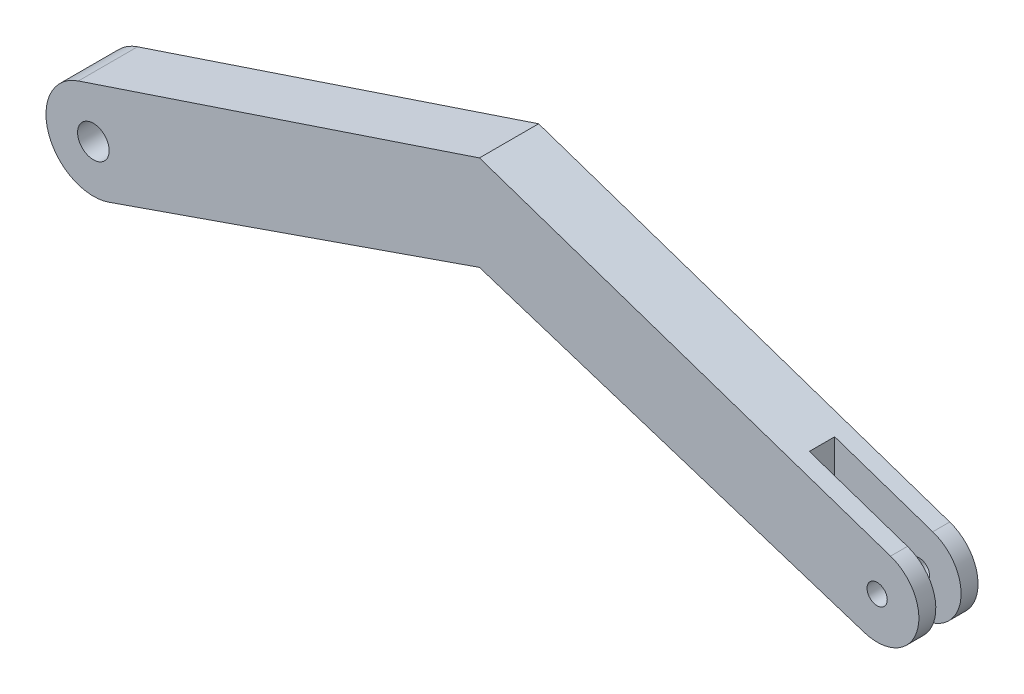
ISO-10303-21;
HEADER;
FILE_DESCRIPTION(('STEP AP214'),'2;1');
FILE_NAME('part.step','',(''),(''),'','','');
FILE_SCHEMA(('AUTOMOTIVE_DESIGN { 1 0 10303 214 1 1 1 1 }'));
ENDSEC;
DATA;
#1=APPLICATION_CONTEXT('core data for automotive mechanical design processes');
#2=APPLICATION_PROTOCOL_DEFINITION('international standard','automotive_design',2000,#1);
#3=PRODUCT_CONTEXT('',#1,'mechanical');
#4=PRODUCT('Part','Part','',(#3));
#5=PRODUCT_RELATED_PRODUCT_CATEGORY('part','',(#4));
#6=PRODUCT_DEFINITION_FORMATION('','',#4);
#7=PRODUCT_DEFINITION_CONTEXT('part definition',#1,'design');
#8=PRODUCT_DEFINITION('design','',#6,#7);
#9=PRODUCT_DEFINITION_SHAPE('','',#8);
#10=(LENGTH_UNIT() NAMED_UNIT(*) SI_UNIT(.MILLI.,.METRE.));
#11=(NAMED_UNIT(*) PLANE_ANGLE_UNIT() SI_UNIT($,.RADIAN.));
#12=(NAMED_UNIT(*) SI_UNIT($,.STERADIAN.) SOLID_ANGLE_UNIT());
#13=UNCERTAINTY_MEASURE_WITH_UNIT(LENGTH_MEASURE(1.E-05),#10,'distance_accuracy_value','');
#14=(GEOMETRIC_REPRESENTATION_CONTEXT(3) GLOBAL_UNCERTAINTY_ASSIGNED_CONTEXT((#13)) GLOBAL_UNIT_ASSIGNED_CONTEXT((#10,
#11,#12)) REPRESENTATION_CONTEXT('',''));
#15=CARTESIAN_POINT('',(0.,0.,0.));
#16=DIRECTION('',(0.,0.,1.));
#17=DIRECTION('',(1.,0.,0.));
#18=AXIS2_PLACEMENT_3D('',#15,#16,#17);
#19=CARTESIAN_POINT('',(0.,0.,2.9718));
#20=DIRECTION('',(0.,0.,-1.));
#21=DIRECTION('',(-1.,0.,0.));
#22=AXIS2_PLACEMENT_3D('',#19,#20,#21);
#23=CYLINDRICAL_SURFACE('',#22,2.0955);
#24=DIRECTION('',(0.,0.,-1.));
#25=VECTOR('',#24,1.);
#26=CARTESIAN_POINT('',(-0.641288820616134,-1.99496087644665,2.9718));
#27=LINE('',#26,#25);
#28=CARTESIAN_POINT('',(-0.641288820616134,-1.99496087644665,2.9718));
#29=VERTEX_POINT('',#28);
#30=CARTESIAN_POINT('',(-0.641288820616133,-1.99496087644665,2.1209));
#31=VERTEX_POINT('',#30);
#32=EDGE_CURVE('E161',#29,#31,#27,.T.);
#33=ORIENTED_EDGE('',*,*,#32,.T.);
#34=CARTESIAN_POINT('',(0.,0.,2.1209));
#35=DIRECTION('',(0.,0.,1.));
#36=DIRECTION('',(1.,0.,0.));
#37=AXIS2_PLACEMENT_3D('',#34,#35,#36);
#38=CIRCLE('',#37,2.0955);
#39=CARTESIAN_POINT('',(0.672616275683253,1.98461774548299,2.1209));
#40=VERTEX_POINT('',#39);
#41=EDGE_CURVE('E192',#31,#40,#38,.T.);
#42=ORIENTED_EDGE('',*,*,#41,.T.);
#43=DIRECTION('',(0.,0.,-1.));
#44=VECTOR('',#43,1.);
#45=CARTESIAN_POINT('',(0.672616275683253,1.98461774548299,2.9718));
#46=LINE('',#45,#44);
#47=CARTESIAN_POINT('',(0.672616275683253,1.98461774548299,2.9718));
#48=VERTEX_POINT('',#47);
#49=EDGE_CURVE('E157',#48,#40,#46,.T.);
#50=ORIENTED_EDGE('',*,*,#49,.F.);
#51=CARTESIAN_POINT('',(0.,0.,2.9718));
#52=DIRECTION('',(0.,0.,1.));
#53=DIRECTION('',(1.,0.,0.));
#54=AXIS2_PLACEMENT_3D('',#51,#52,#53);
#55=CIRCLE('',#54,2.0955);
#56=EDGE_CURVE('E98',#29,#48,#55,.T.);
#57=ORIENTED_EDGE('',*,*,#56,.F.);
#58=EDGE_LOOP('',(#33,#42,#50,#57));
#59=FACE_BOUND('',#58,.T.);
#60=ADVANCED_FACE('F37',(#59),#23,.T.);
#61=CARTESIAN_POINT('',(-0.641288820616135,-1.99496087644665,2.9718));
#62=DIRECTION('',(0.306031410458666,0.952021415627127,0.));
#63=DIRECTION('',(-0.952021415627128,0.306031410458666,0.));
#64=AXIS2_PLACEMENT_3D('',#61,#62,#63);
#65=PLANE('',#64);
#66=DIRECTION('',(0.,0.,1.));
#67=VECTOR('',#66,1.);
#68=CARTESIAN_POINT('',(-4.2545,-0.833478481868933,2.9718));
#69=LINE('',#68,#67);
#70=CARTESIAN_POINT('',(-4.2545,-0.833478481868932,0.8509));
#71=VERTEX_POINT('',#70);
#72=CARTESIAN_POINT('',(-4.2545,-0.833478481868932,2.1209));
#73=VERTEX_POINT('',#72);
#74=EDGE_CURVE('E194',#71,#73,#69,.T.);
#75=ORIENTED_EDGE('',*,*,#74,.T.);
#76=DIRECTION('',(0.952021415627128,-0.306031410458666,0.));
#77=VECTOR('',#76,1.);
#78=CARTESIAN_POINT('',(-0.641288820616135,-1.99496087644665,2.1209));
#79=LINE('',#78,#77);
#80=EDGE_CURVE('E139',#73,#31,#79,.T.);
#81=ORIENTED_EDGE('',*,*,#80,.T.);
#82=ORIENTED_EDGE('',*,*,#32,.F.);
#83=DIRECTION('',(0.952021415627127,-0.306031410458666,0.));
#84=VECTOR('',#83,1.);
#85=CARTESIAN_POINT('',(-0.641288820616135,-1.99496087644665,2.9718));
#86=LINE('',#85,#84);
#87=CARTESIAN_POINT('',(-19.9775441457523,4.2207622081462,2.9718));
#88=VERTEX_POINT('',#87);
#89=EDGE_CURVE('E203',#88,#29,#86,.T.);
#90=ORIENTED_EDGE('',*,*,#89,.F.);
#91=DIRECTION('',(0.,0.,-1.));
#92=VECTOR('',#91,1.);
#93=CARTESIAN_POINT('',(-19.9775441457523,4.2207622081462,2.9718));
#94=LINE('',#93,#92);
#95=CARTESIAN_POINT('',(-19.9775441457523,4.2207622081462,0.));
#96=VERTEX_POINT('',#95);
#97=EDGE_CURVE('E134',#88,#96,#94,.T.);
#98=ORIENTED_EDGE('',*,*,#97,.T.);
#99=DIRECTION('',(0.952021415627127,-0.306031410458666,0.));
#100=VECTOR('',#99,1.);
#101=CARTESIAN_POINT('',(-0.641288820616135,-1.99496087644665,0.));
#102=LINE('',#101,#100);
#103=CARTESIAN_POINT('',(-0.641288820616134,-1.99496087644665,0.));
#104=VERTEX_POINT('',#103);
#105=EDGE_CURVE('E138',#96,#104,#102,.T.);
#106=ORIENTED_EDGE('',*,*,#105,.T.);
#107=CARTESIAN_POINT('',(-0.641288820616133,-1.99496087644665,0.8509));
#108=VERTEX_POINT('',#107);
#109=EDGE_CURVE('E160',#108,#104,#27,.T.);
#110=ORIENTED_EDGE('',*,*,#109,.F.);
#111=DIRECTION('',(-0.952021415627128,0.306031410458666,0.));
#112=VECTOR('',#111,1.);
#113=CARTESIAN_POINT('',(-0.641288820616135,-1.99496087644665,0.8509));
#114=LINE('',#113,#112);
#115=EDGE_CURVE('E197',#108,#71,#114,.T.);
#116=ORIENTED_EDGE('',*,*,#115,.T.);
#117=EDGE_LOOP('',(#75,#81,#82,#90,#98,#106,#110,#116));
#118=FACE_BOUND('',#117,.T.);
#119=ADVANCED_FACE('F206',(#118),#65,.F.);
#120=CARTESIAN_POINT('',(0.672616275683253,1.98461774548299,0.8509));
#121=VERTEX_POINT('',#120);
#122=CARTESIAN_POINT('',(0.672616275683253,1.98461774548299,0.));
#123=VERTEX_POINT('',#122);
#124=EDGE_CURVE('E156',#121,#123,#46,.T.);
#125=ORIENTED_EDGE('',*,*,#124,.F.);
#126=CARTESIAN_POINT('',(0.,0.,0.8509));
#127=DIRECTION('',(0.,0.,-1.));
#128=DIRECTION('',(-1.,0.,0.));
#129=AXIS2_PLACEMENT_3D('',#126,#127,#128);
#130=CIRCLE('',#129,2.0955);
#131=EDGE_CURVE('E53',#121,#108,#130,.T.);
#132=ORIENTED_EDGE('',*,*,#131,.T.);
#133=ORIENTED_EDGE('',*,*,#109,.T.);
#134=CARTESIAN_POINT('',(0.,0.,0.));
#135=DIRECTION('',(0.,0.,1.));
#136=DIRECTION('',(1.,0.,0.));
#137=AXIS2_PLACEMENT_3D('',#134,#135,#136);
#138=CIRCLE('',#137,2.0955);
#139=EDGE_CURVE('E142',#104,#123,#138,.T.);
#140=ORIENTED_EDGE('',*,*,#139,.T.);
#141=EDGE_LOOP('',(#125,#132,#133,#140));
#142=FACE_BOUND('',#141,.T.);
#143=ADVANCED_FACE('F221',(#142),#23,.T.);
#144=CARTESIAN_POINT('',(0.672616275683252,1.98461774548299,2.9718));
#145=DIRECTION('',(0.320981281643165,0.947085538288232,0.));
#146=DIRECTION('',(-0.947085538288232,0.320981281643166,0.));
#147=AXIS2_PLACEMENT_3D('',#144,#145,#146);
#148=PLANE('',#147);
#149=DIRECTION('',(0.947085538288232,-0.320981281643166,0.));
#150=VECTOR('',#149,1.);
#151=CARTESIAN_POINT('',(0.672616275683252,1.98461774548299,2.1209));
#152=LINE('',#151,#150);
#153=CARTESIAN_POINT('',(-4.2545,3.65449024700185,2.1209));
#154=VERTEX_POINT('',#153);
#155=EDGE_CURVE('E11',#154,#40,#152,.T.);
#156=ORIENTED_EDGE('',*,*,#155,.F.);
#157=DIRECTION('',(0.,0.,1.));
#158=VECTOR('',#157,1.);
#159=CARTESIAN_POINT('',(-4.2545,3.65449024700185,2.9718));
#160=LINE('',#159,#158);
#161=CARTESIAN_POINT('',(-4.2545,3.65449024700185,0.8509));
#162=VERTEX_POINT('',#161);
#163=EDGE_CURVE('E46',#162,#154,#160,.T.);
#164=ORIENTED_EDGE('',*,*,#163,.F.);
#165=DIRECTION('',(-0.947085538288232,0.320981281643166,0.));
#166=VECTOR('',#165,1.);
#167=CARTESIAN_POINT('',(0.672616275683252,1.98461774548299,0.8509));
#168=LINE('',#167,#166);
#169=EDGE_CURVE('E163',#121,#162,#168,.T.);
#170=ORIENTED_EDGE('',*,*,#169,.F.);
#171=ORIENTED_EDGE('',*,*,#124,.T.);
#172=DIRECTION('',(0.947085538288232,-0.320981281643166,0.));
#173=VECTOR('',#172,1.);
#174=CARTESIAN_POINT('',(0.672616275683252,1.98461774548299,0.));
#175=LINE('',#174,#173);
#176=CARTESIAN_POINT('',(-19.9775441457523,8.9832622081462,0.));
#177=VERTEX_POINT('',#176);
#178=EDGE_CURVE('E145',#177,#123,#175,.T.);
#179=ORIENTED_EDGE('',*,*,#178,.F.);
#180=DIRECTION('',(0.,0.,-1.));
#181=VECTOR('',#180,1.);
#182=CARTESIAN_POINT('',(-19.9775441457523,8.9832622081462,2.9718));
#183=LINE('',#182,#181);
#184=CARTESIAN_POINT('',(-19.9775441457523,8.9832622081462,2.9718));
#185=VERTEX_POINT('',#184);
#186=EDGE_CURVE('E118',#185,#177,#183,.T.);
#187=ORIENTED_EDGE('',*,*,#186,.F.);
#188=DIRECTION('',(0.947085538288232,-0.320981281643166,0.));
#189=VECTOR('',#188,1.);
#190=CARTESIAN_POINT('',(0.672616275683252,1.98461774548299,2.9718));
#191=LINE('',#190,#189);
#192=EDGE_CURVE('E128',#185,#48,#191,.T.);
#193=ORIENTED_EDGE('',*,*,#192,.T.);
#194=ORIENTED_EDGE('',*,*,#49,.T.);
#195=EDGE_LOOP('',(#156,#164,#170,#171,#179,#187,#193,#194));
#196=FACE_BOUND('',#195,.T.);
#197=ADVANCED_FACE('F191',(#196),#148,.T.);
#198=CARTESIAN_POINT('',(-4.70048748680265,14.0824790142239,2.9718));
#199=DIRECTION('',(-0.316611341294423,0.948555353452684,0.));
#200=DIRECTION('',(-0.948555353452684,-0.316611341294423,0.));
#201=AXIS2_PLACEMENT_3D('',#198,#199,#200);
#202=PLANE('',#201);
#203=DIRECTION('',(0.948555353452684,0.316611341294423,0.));
#204=VECTOR('',#203,1.);
#205=CARTESIAN_POINT('',(-4.70048748680265,14.0824790142239,0.));
#206=LINE('',#205,#204);
#207=CARTESIAN_POINT('',(-40.1239307564573,2.2587474354092,0.));
#208=VERTEX_POINT('',#207);
#209=EDGE_CURVE('E115',#208,#177,#206,.T.);
#210=ORIENTED_EDGE('',*,*,#209,.F.);
#211=DIRECTION('',(0.,0.,-1.));
#212=VECTOR('',#211,1.);
#213=CARTESIAN_POINT('',(-40.1239307564573,2.2587474354092,2.9718));
#214=LINE('',#213,#212);
#215=CARTESIAN_POINT('',(-40.1239307564573,2.2587474354092,2.9718));
#216=VERTEX_POINT('',#215);
#217=EDGE_CURVE('E109',#216,#208,#214,.T.);
#218=ORIENTED_EDGE('',*,*,#217,.F.);
#219=DIRECTION('',(0.948555353452684,0.316611341294423,0.));
#220=VECTOR('',#219,1.);
#221=CARTESIAN_POINT('',(-4.70048748680265,14.0824790142239,2.9718));
#222=LINE('',#221,#220);
#223=EDGE_CURVE('E113',#216,#185,#222,.T.);
#224=ORIENTED_EDGE('',*,*,#223,.T.);
#225=ORIENTED_EDGE('',*,*,#186,.T.);
#226=EDGE_LOOP('',(#210,#218,#224,#225));
#227=FACE_BOUND('',#226,.T.);
#228=ADVANCED_FACE('F111',(#227),#202,.T.);
#229=CARTESIAN_POINT('',(-39.37,0.,2.9718));
#230=DIRECTION('',(0.,0.,-1.));
#231=DIRECTION('',(-1.,0.,0.));
#232=AXIS2_PLACEMENT_3D('',#229,#230,#231);
#233=CYLINDRICAL_SURFACE('',#232,2.38125);
#234=CARTESIAN_POINT('',(-39.37,0.,0.));
#235=DIRECTION('',(0.,0.,1.));
#236=DIRECTION('',(1.,0.,0.));
#237=AXIS2_PLACEMENT_3D('',#234,#235,#236);
#238=CIRCLE('',#237,2.38125);
#239=CARTESIAN_POINT('',(-38.5880613198563,-2.24920507357491,0.));
#240=VERTEX_POINT('',#239);
#241=EDGE_CURVE('E149',#208,#240,#238,.T.);
#242=ORIENTED_EDGE('',*,*,#241,.T.);
#243=DIRECTION('',(0.,0.,-1.));
#244=VECTOR('',#243,1.);
#245=CARTESIAN_POINT('',(-38.5880613198563,-2.24920507357491,2.9718));
#246=LINE('',#245,#244);
#247=CARTESIAN_POINT('',(-38.5880613198563,-2.24920507357491,2.9718));
#248=VERTEX_POINT('',#247);
#249=EDGE_CURVE('E119',#248,#240,#246,.T.);
#250=ORIENTED_EDGE('',*,*,#249,.F.);
#251=CARTESIAN_POINT('',(-39.37,0.,2.9718));
#252=DIRECTION('',(0.,0.,1.));
#253=DIRECTION('',(1.,0.,0.));
#254=AXIS2_PLACEMENT_3D('',#251,#252,#253);
#255=CIRCLE('',#254,2.38125);
#256=EDGE_CURVE('E122',#216,#248,#255,.T.);
#257=ORIENTED_EDGE('',*,*,#256,.F.);
#258=ORIENTED_EDGE('',*,*,#217,.T.);
#259=EDGE_LOOP('',(#242,#250,#257,#258));
#260=FACE_BOUND('',#259,.T.);
#261=ADVANCED_FACE('F123',(#260),#233,.T.);
#262=CARTESIAN_POINT('',(-39.37,0.,2.9718));
#263=DIRECTION('',(0.,0.,-1.));
#264=DIRECTION('',(-1.,0.,0.));
#265=AXIS2_PLACEMENT_3D('',#262,#263,#264);
#266=CYLINDRICAL_SURFACE('',#265,0.79375);
#267=CARTESIAN_POINT('',(-39.37,0.,2.9718));
#268=DIRECTION('',(0.,0.,1.));
#269=DIRECTION('',(1.,0.,0.));
#270=AXIS2_PLACEMENT_3D('',#267,#268,#269);
#271=CIRCLE('',#270,0.79375);
#272=CARTESIAN_POINT('',(-38.57625,0.,2.9718));
#273=VERTEX_POINT('',#272);
#274=EDGE_CURVE('E152',#273,#273,#271,.T.);
#275=ORIENTED_EDGE('',*,*,#274,.T.);
#276=EDGE_LOOP('',(#275));
#277=FACE_BOUND('',#276,.T.);
#278=CARTESIAN_POINT('',(-39.37,0.,0.));
#279=DIRECTION('',(0.,0.,1.));
#280=DIRECTION('',(1.,0.,0.));
#281=AXIS2_PLACEMENT_3D('',#278,#279,#280);
#282=CIRCLE('',#281,0.79375);
#283=CARTESIAN_POINT('',(-38.57625,0.,0.));
#284=VERTEX_POINT('',#283);
#285=EDGE_CURVE('E135',#284,#284,#282,.T.);
#286=ORIENTED_EDGE('',*,*,#285,.F.);
#287=EDGE_LOOP('',(#286));
#288=FACE_BOUND('',#287,.T.);
#289=ADVANCED_FACE('F39',(#277,#288),#266,.F.);
#290=CARTESIAN_POINT('',(-3.46328738955953,9.96196219173305,2.9718));
#291=DIRECTION('',(-0.328373199010483,0.944548062393662,0.));
#292=DIRECTION('',(-0.944548062393663,-0.328373199010483,0.));
#293=AXIS2_PLACEMENT_3D('',#290,#291,#292);
#294=PLANE('',#293);
#295=DIRECTION('',(0.944548062393662,0.328373199010483,0.));
#296=VECTOR('',#295,1.);
#297=CARTESIAN_POINT('',(-3.46328738955953,9.96196219173305,0.));
#298=LINE('',#297,#296);
#299=EDGE_CURVE('E89',#240,#96,#298,.T.);
#300=ORIENTED_EDGE('',*,*,#299,.T.);
#301=ORIENTED_EDGE('',*,*,#97,.F.);
#302=DIRECTION('',(0.944548062393662,0.328373199010483,0.));
#303=VECTOR('',#302,1.);
#304=CARTESIAN_POINT('',(-3.46328738955953,9.96196219173305,2.9718));
#305=LINE('',#304,#303);
#306=EDGE_CURVE('E62',#248,#88,#305,.T.);
#307=ORIENTED_EDGE('',*,*,#306,.F.);
#308=ORIENTED_EDGE('',*,*,#249,.T.);
#309=EDGE_LOOP('',(#300,#301,#307,#308));
#310=FACE_BOUND('',#309,.T.);
#311=ADVANCED_FACE('F228',(#310),#294,.F.);
#312=CARTESIAN_POINT('',(0.,0.,2.9718));
#313=DIRECTION('',(0.,0.,1.));
#314=DIRECTION('',(1.,0.,0.));
#315=AXIS2_PLACEMENT_3D('',#312,#313,#314);
#316=PLANE('',#315);
#317=CARTESIAN_POINT('',(0.,0.,2.9718));
#318=DIRECTION('',(0.,0.,1.));
#319=DIRECTION('',(1.,0.,0.));
#320=AXIS2_PLACEMENT_3D('',#317,#318,#319);
#321=CIRCLE('',#320,0.508);
#322=CARTESIAN_POINT('',(0.508,0.,2.9718));
#323=VERTEX_POINT('',#322);
#324=EDGE_CURVE('E352',#323,#323,#321,.T.);
#325=ORIENTED_EDGE('',*,*,#324,.F.);
#326=EDGE_LOOP('',(#325));
#327=FACE_BOUND('',#326,.T.);
#328=ORIENTED_EDGE('',*,*,#274,.F.);
#329=EDGE_LOOP('',(#328));
#330=FACE_BOUND('',#329,.T.);
#331=ORIENTED_EDGE('',*,*,#89,.T.);
#332=ORIENTED_EDGE('',*,*,#56,.T.);
#333=ORIENTED_EDGE('',*,*,#192,.F.);
#334=ORIENTED_EDGE('',*,*,#223,.F.);
#335=ORIENTED_EDGE('',*,*,#256,.T.);
#336=ORIENTED_EDGE('',*,*,#306,.T.);
#337=EDGE_LOOP('',(#331,#332,#333,#334,#335,#336));
#338=FACE_BOUND('',#337,.T.);
#339=ADVANCED_FACE('F126',(#327,#330,#338),#316,.T.);
#340=CARTESIAN_POINT('',(0.,0.,0.));
#341=DIRECTION('',(0.,0.,1.));
#342=DIRECTION('',(1.,0.,0.));
#343=AXIS2_PLACEMENT_3D('',#340,#341,#342);
#344=PLANE('',#343);
#345=CARTESIAN_POINT('',(0.,0.,0.));
#346=DIRECTION('',(0.,0.,1.));
#347=DIRECTION('',(1.,0.,0.));
#348=AXIS2_PLACEMENT_3D('',#345,#346,#347);
#349=CIRCLE('',#348,0.508);
#350=CARTESIAN_POINT('',(0.508,0.,0.));
#351=VERTEX_POINT('',#350);
#352=EDGE_CURVE('E354',#351,#351,#349,.T.);
#353=ORIENTED_EDGE('',*,*,#352,.T.);
#354=EDGE_LOOP('',(#353));
#355=FACE_BOUND('',#354,.T.);
#356=ORIENTED_EDGE('',*,*,#285,.T.);
#357=EDGE_LOOP('',(#356));
#358=FACE_BOUND('',#357,.T.);
#359=ORIENTED_EDGE('',*,*,#105,.F.);
#360=ORIENTED_EDGE('',*,*,#299,.F.);
#361=ORIENTED_EDGE('',*,*,#241,.F.);
#362=ORIENTED_EDGE('',*,*,#209,.T.);
#363=ORIENTED_EDGE('',*,*,#178,.T.);
#364=ORIENTED_EDGE('',*,*,#139,.F.);
#365=EDGE_LOOP('',(#359,#360,#361,#362,#363,#364));
#366=FACE_BOUND('',#365,.T.);
#367=ADVANCED_FACE('F226',(#355,#358,#366),#344,.F.);
#368=CARTESIAN_POINT('',(-4.2545,-2.38125,2.1209));
#369=DIRECTION('',(0.,0.,1.));
#370=DIRECTION('',(1.,0.,0.));
#371=AXIS2_PLACEMENT_3D('',#368,#369,#370);
#372=PLANE('',#371);
#373=CARTESIAN_POINT('',(0.,0.,2.1209));
#374=DIRECTION('',(0.,0.,1.));
#375=DIRECTION('',(1.,0.,0.));
#376=AXIS2_PLACEMENT_3D('',#373,#374,#375);
#377=CIRCLE('',#376,0.508);
#378=CARTESIAN_POINT('',(0.508,0.,2.1209));
#379=VERTEX_POINT('',#378);
#380=EDGE_CURVE('E214',#379,#379,#377,.F.);
#381=ORIENTED_EDGE('',*,*,#380,.F.);
#382=EDGE_LOOP('',(#381));
#383=FACE_BOUND('',#382,.T.);
#384=DIRECTION('',(0.,1.,0.));
#385=VECTOR('',#384,1.);
#386=CARTESIAN_POINT('',(-4.2545,-2.38125,2.1209));
#387=LINE('',#386,#385);
#388=EDGE_CURVE('E175',#73,#154,#387,.T.);
#389=ORIENTED_EDGE('',*,*,#388,.T.);
#390=ORIENTED_EDGE('',*,*,#155,.T.);
#391=ORIENTED_EDGE('',*,*,#41,.F.);
#392=ORIENTED_EDGE('',*,*,#80,.F.);
#393=EDGE_LOOP('',(#389,#390,#391,#392));
#394=FACE_BOUND('',#393,.T.);
#395=ADVANCED_FACE('F186',(#383,#394),#372,.F.);
#396=CARTESIAN_POINT('',(-4.2545,-2.38125,2.1209));
#397=DIRECTION('',(-1.,0.,0.));
#398=DIRECTION('',(0.,0.,1.));
#399=AXIS2_PLACEMENT_3D('',#396,#397,#398);
#400=PLANE('',#399);
#401=DIRECTION('',(0.,1.,0.));
#402=VECTOR('',#401,1.);
#403=CARTESIAN_POINT('',(-4.2545,-2.38125,0.8509));
#404=LINE('',#403,#402);
#405=EDGE_CURVE('E179',#71,#162,#404,.T.);
#406=ORIENTED_EDGE('',*,*,#405,.T.);
#407=ORIENTED_EDGE('',*,*,#163,.T.);
#408=ORIENTED_EDGE('',*,*,#388,.F.);
#409=ORIENTED_EDGE('',*,*,#74,.F.);
#410=EDGE_LOOP('',(#406,#407,#408,#409));
#411=FACE_BOUND('',#410,.T.);
#412=ADVANCED_FACE('F172',(#411),#400,.F.);
#413=CARTESIAN_POINT('',(-4.2545,-2.38125,0.8509));
#414=DIRECTION('',(0.,0.,-1.));
#415=DIRECTION('',(-1.,0.,0.));
#416=AXIS2_PLACEMENT_3D('',#413,#414,#415);
#417=PLANE('',#416);
#418=CARTESIAN_POINT('',(0.,0.,0.8509));
#419=DIRECTION('',(0.,0.,-1.));
#420=DIRECTION('',(-1.,0.,0.));
#421=AXIS2_PLACEMENT_3D('',#418,#419,#420);
#422=CIRCLE('',#421,0.508);
#423=CARTESIAN_POINT('',(-0.508,0.,0.8509));
#424=VERTEX_POINT('',#423);
#425=EDGE_CURVE('E41',#424,#424,#422,.F.);
#426=ORIENTED_EDGE('',*,*,#425,.F.);
#427=EDGE_LOOP('',(#426));
#428=FACE_BOUND('',#427,.T.);
#429=ORIENTED_EDGE('',*,*,#131,.F.);
#430=ORIENTED_EDGE('',*,*,#169,.T.);
#431=ORIENTED_EDGE('',*,*,#405,.F.);
#432=ORIENTED_EDGE('',*,*,#115,.F.);
#433=EDGE_LOOP('',(#429,#430,#431,#432));
#434=FACE_BOUND('',#433,.T.);
#435=ADVANCED_FACE('F213',(#428,#434),#417,.F.);
#436=CARTESIAN_POINT('',(0.,0.,2.9718));
#437=DIRECTION('',(0.,0.,-1.));
#438=DIRECTION('',(-1.,0.,0.));
#439=AXIS2_PLACEMENT_3D('',#436,#437,#438);
#440=CYLINDRICAL_SURFACE('',#439,0.508);
#441=ORIENTED_EDGE('',*,*,#352,.F.);
#442=EDGE_LOOP('',(#441));
#443=FACE_BOUND('',#442,.T.);
#444=ORIENTED_EDGE('',*,*,#425,.T.);
#445=EDGE_LOOP('',(#444));
#446=FACE_BOUND('',#445,.T.);
#447=ADVANCED_FACE('F326',(#443,#446),#440,.F.);
#448=ORIENTED_EDGE('',*,*,#324,.T.);
#449=EDGE_LOOP('',(#448));
#450=FACE_BOUND('',#449,.T.);
#451=ORIENTED_EDGE('',*,*,#380,.T.);
#452=EDGE_LOOP('',(#451));
#453=FACE_BOUND('',#452,.T.);
#454=ADVANCED_FACE('F336',(#450,#453),#440,.F.);
#455=CLOSED_SHELL('',(#60,#119,#143,#197,#228,#261,#289,#311,#339,#367,#395,#412,#435,#447,#454));
#456=MANIFOLD_SOLID_BREP('B2',#455);
#457=ADVANCED_BREP_SHAPE_REPRESENTATION('',(#18,#456),#14);
#458=SHAPE_DEFINITION_REPRESENTATION(#9,#457);
ENDSEC;
END-ISO-10303-21;
